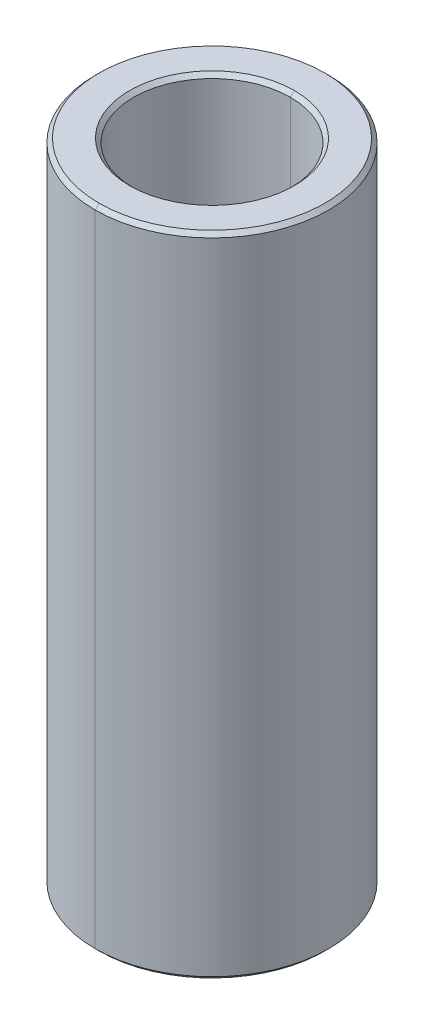
ISO-10303-21;
HEADER;
FILE_DESCRIPTION(('STEP AP214'),'2;1');
FILE_NAME('part.step','',(''),(''),'','','');
FILE_SCHEMA(('AUTOMOTIVE_DESIGN { 1 0 10303 214 1 1 1 1 }'));
ENDSEC;
DATA;
#1=APPLICATION_CONTEXT('core data for automotive mechanical design processes');
#2=APPLICATION_PROTOCOL_DEFINITION('international standard','automotive_design',2000,#1);
#3=PRODUCT_CONTEXT('',#1,'mechanical');
#4=PRODUCT('Part','Part','',(#3));
#5=PRODUCT_RELATED_PRODUCT_CATEGORY('part','',(#4));
#6=PRODUCT_DEFINITION_FORMATION('','',#4);
#7=PRODUCT_DEFINITION_CONTEXT('part definition',#1,'design');
#8=PRODUCT_DEFINITION('design','',#6,#7);
#9=PRODUCT_DEFINITION_SHAPE('','',#8);
#10=(LENGTH_UNIT() NAMED_UNIT(*) SI_UNIT(.MILLI.,.METRE.));
#11=(NAMED_UNIT(*) PLANE_ANGLE_UNIT() SI_UNIT($,.RADIAN.));
#12=(NAMED_UNIT(*) SI_UNIT($,.STERADIAN.) SOLID_ANGLE_UNIT());
#13=UNCERTAINTY_MEASURE_WITH_UNIT(LENGTH_MEASURE(1.E-05),#10,'distance_accuracy_value','');
#14=(GEOMETRIC_REPRESENTATION_CONTEXT(3) GLOBAL_UNCERTAINTY_ASSIGNED_CONTEXT((#13)) GLOBAL_UNIT_ASSIGNED_CONTEXT((#10,
#11,#12)) REPRESENTATION_CONTEXT('',''));
#15=CARTESIAN_POINT('',(0.,0.,0.));
#16=DIRECTION('',(0.,0.,1.));
#17=DIRECTION('',(1.,0.,0.));
#18=AXIS2_PLACEMENT_3D('',#15,#16,#17);
#19=CARTESIAN_POINT('',(0.,8.15,0.));
#20=DIRECTION('',(0.,1.,0.));
#21=DIRECTION('',(0.,0.,1.));
#22=AXIS2_PLACEMENT_3D('',#19,#20,#21);
#23=CONICAL_SURFACE('',#22,2.,0.785398163397448);
#24=DIRECTION('',(0.,0.707106781186548,-0.707106781186548));
#25=VECTOR('',#24,1.);
#26=CARTESIAN_POINT('',(0.,8.15,-2.));
#27=LINE('',#26,#25);
#28=CARTESIAN_POINT('',(0.,8.15,-2.));
#29=VERTEX_POINT('',#28);
#30=CARTESIAN_POINT('',(0.,8.25,-2.1));
#31=VERTEX_POINT('',#30);
#32=EDGE_CURVE('E147',#29,#31,#27,.T.);
#33=ORIENTED_EDGE('',*,*,#32,.F.);
#34=CARTESIAN_POINT('',(0.,8.15,0.));
#35=DIRECTION('',(0.,1.,0.));
#36=DIRECTION('',(0.,0.,1.));
#37=AXIS2_PLACEMENT_3D('',#34,#35,#36);
#38=CIRCLE('',#37,2.);
#39=CARTESIAN_POINT('',(0.,8.15,2.));
#40=VERTEX_POINT('',#39);
#41=EDGE_CURVE('E25',#40,#29,#38,.T.);
#42=ORIENTED_EDGE('',*,*,#41,.F.);
#43=DIRECTION('',(0.,0.707106781186548,0.707106781186548));
#44=VECTOR('',#43,1.);
#45=CARTESIAN_POINT('',(0.,8.15,2.));
#46=LINE('',#45,#44);
#47=CARTESIAN_POINT('',(0.,8.25,2.1));
#48=VERTEX_POINT('',#47);
#49=EDGE_CURVE('E116',#40,#48,#46,.T.);
#50=ORIENTED_EDGE('',*,*,#49,.T.);
#51=CARTESIAN_POINT('',(0.,8.25,0.));
#52=DIRECTION('',(0.,-1.,0.));
#53=DIRECTION('',(0.,0.,1.));
#54=AXIS2_PLACEMENT_3D('',#51,#52,#53);
#55=CIRCLE('',#54,2.1);
#56=EDGE_CURVE('E130',#31,#48,#55,.T.);
#57=ORIENTED_EDGE('',*,*,#56,.F.);
#58=EDGE_LOOP('',(#33,#42,#50,#57));
#59=FACE_BOUND('',#58,.T.);
#60=ADVANCED_FACE('F14',(#59),#23,.F.);
#61=CARTESIAN_POINT('',(0.,-8.25,0.));
#62=DIRECTION('',(0.,-1.,0.));
#63=DIRECTION('',(0.,0.,-1.));
#64=AXIS2_PLACEMENT_3D('',#61,#62,#63);
#65=CONICAL_SURFACE('',#64,2.1,0.785398163397448);
#66=DIRECTION('',(0.,-0.707106781186548,0.707106781186548));
#67=VECTOR('',#66,1.);
#68=CARTESIAN_POINT('',(0.,-8.25,2.1));
#69=LINE('',#68,#67);
#70=CARTESIAN_POINT('',(0.,-8.15,2.));
#71=VERTEX_POINT('',#70);
#72=CARTESIAN_POINT('',(0.,-8.25,2.1));
#73=VERTEX_POINT('',#72);
#74=EDGE_CURVE('E91',#71,#73,#69,.T.);
#75=ORIENTED_EDGE('',*,*,#74,.F.);
#76=CARTESIAN_POINT('',(0.,-8.15,0.));
#77=DIRECTION('',(0.,-1.,0.));
#78=DIRECTION('',(0.,0.,1.));
#79=AXIS2_PLACEMENT_3D('',#76,#77,#78);
#80=CIRCLE('',#79,2.);
#81=CARTESIAN_POINT('',(0.,-8.15,-2.));
#82=VERTEX_POINT('',#81);
#83=EDGE_CURVE('E9',#82,#71,#80,.T.);
#84=ORIENTED_EDGE('',*,*,#83,.F.);
#85=DIRECTION('',(0.,-0.707106781186548,-0.707106781186548));
#86=VECTOR('',#85,1.);
#87=CARTESIAN_POINT('',(0.,-8.25,-2.1));
#88=LINE('',#87,#86);
#89=CARTESIAN_POINT('',(0.,-8.25,-2.1));
#90=VERTEX_POINT('',#89);
#91=EDGE_CURVE('E94',#82,#90,#88,.T.);
#92=ORIENTED_EDGE('',*,*,#91,.T.);
#93=CARTESIAN_POINT('',(0.,-8.25,0.));
#94=DIRECTION('',(0.,1.,0.));
#95=DIRECTION('',(0.,0.,1.));
#96=AXIS2_PLACEMENT_3D('',#93,#94,#95);
#97=CIRCLE('',#96,2.1);
#98=EDGE_CURVE('E87',#73,#90,#97,.T.);
#99=ORIENTED_EDGE('',*,*,#98,.F.);
#100=EDGE_LOOP('',(#75,#84,#92,#99));
#101=FACE_BOUND('',#100,.T.);
#102=ADVANCED_FACE('F89',(#101),#65,.F.);
#103=CARTESIAN_POINT('',(0.,8.25,0.));
#104=DIRECTION('',(0.,-1.,0.));
#105=DIRECTION('',(0.,0.,-1.));
#106=AXIS2_PLACEMENT_3D('',#103,#104,#105);
#107=CONICAL_SURFACE('',#106,2.875,0.785398163397457);
#108=DIRECTION('',(0.,-0.707106781186542,0.707106781186554));
#109=VECTOR('',#108,1.);
#110=CARTESIAN_POINT('',(0.,8.25,2.875));
#111=LINE('',#110,#109);
#112=CARTESIAN_POINT('',(0.,8.25,2.875));
#113=VERTEX_POINT('',#112);
#114=CARTESIAN_POINT('',(0.,8.15,2.975));
#115=VERTEX_POINT('',#114);
#116=EDGE_CURVE('E141',#113,#115,#111,.T.);
#117=ORIENTED_EDGE('',*,*,#116,.F.);
#118=CARTESIAN_POINT('',(0.,8.25,0.));
#119=DIRECTION('',(0.,1.,0.));
#120=DIRECTION('',(0.,0.,1.));
#121=AXIS2_PLACEMENT_3D('',#118,#119,#120);
#122=CIRCLE('',#121,2.875);
#123=CARTESIAN_POINT('',(0.,8.25,-2.875));
#124=VERTEX_POINT('',#123);
#125=EDGE_CURVE('E145',#124,#113,#122,.T.);
#126=ORIENTED_EDGE('',*,*,#125,.F.);
#127=DIRECTION('',(0.,-0.707106781186542,-0.707106781186554));
#128=VECTOR('',#127,1.);
#129=CARTESIAN_POINT('',(0.,8.25,-2.875));
#130=LINE('',#129,#128);
#131=CARTESIAN_POINT('',(0.,8.15,-2.975));
#132=VERTEX_POINT('',#131);
#133=EDGE_CURVE('E161',#124,#132,#130,.T.);
#134=ORIENTED_EDGE('',*,*,#133,.T.);
#135=CARTESIAN_POINT('',(0.,8.15,0.));
#136=DIRECTION('',(0.,-1.,0.));
#137=DIRECTION('',(0.,0.,1.));
#138=AXIS2_PLACEMENT_3D('',#135,#136,#137);
#139=CIRCLE('',#138,2.975);
#140=EDGE_CURVE('E98',#115,#132,#139,.T.);
#141=ORIENTED_EDGE('',*,*,#140,.F.);
#142=EDGE_LOOP('',(#117,#126,#134,#141));
#143=FACE_BOUND('',#142,.T.);
#144=ADVANCED_FACE('F224',(#143),#107,.T.);
#145=CARTESIAN_POINT('',(0.,-8.15,0.));
#146=DIRECTION('',(0.,1.,0.));
#147=DIRECTION('',(0.,0.,1.));
#148=AXIS2_PLACEMENT_3D('',#145,#146,#147);
#149=CONICAL_SURFACE('',#148,2.975,0.785398163397448);
#150=DIRECTION('',(0.,0.707106781186548,-0.707106781186548));
#151=VECTOR('',#150,1.);
#152=CARTESIAN_POINT('',(0.,-8.15,-2.975));
#153=LINE('',#152,#151);
#154=CARTESIAN_POINT('',(0.,-8.25,-2.875));
#155=VERTEX_POINT('',#154);
#156=CARTESIAN_POINT('',(0.,-8.15,-2.975));
#157=VERTEX_POINT('',#156);
#158=EDGE_CURVE('E156',#155,#157,#153,.T.);
#159=ORIENTED_EDGE('',*,*,#158,.F.);
#160=CARTESIAN_POINT('',(0.,-8.25,0.));
#161=DIRECTION('',(0.,-1.,0.));
#162=DIRECTION('',(0.,0.,1.));
#163=AXIS2_PLACEMENT_3D('',#160,#161,#162);
#164=CIRCLE('',#163,2.875);
#165=CARTESIAN_POINT('',(0.,-8.25,2.875));
#166=VERTEX_POINT('',#165);
#167=EDGE_CURVE('E99',#166,#155,#164,.T.);
#168=ORIENTED_EDGE('',*,*,#167,.F.);
#169=DIRECTION('',(0.,0.707106781186548,0.707106781186548));
#170=VECTOR('',#169,1.);
#171=CARTESIAN_POINT('',(0.,-8.15,2.975));
#172=LINE('',#171,#170);
#173=CARTESIAN_POINT('',(0.,-8.15,2.975));
#174=VERTEX_POINT('',#173);
#175=EDGE_CURVE('E127',#166,#174,#172,.T.);
#176=ORIENTED_EDGE('',*,*,#175,.T.);
#177=CARTESIAN_POINT('',(0.,-8.15,0.));
#178=DIRECTION('',(0.,1.,0.));
#179=DIRECTION('',(0.,0.,1.));
#180=AXIS2_PLACEMENT_3D('',#177,#178,#179);
#181=CIRCLE('',#180,2.975);
#182=EDGE_CURVE('E40',#157,#174,#181,.T.);
#183=ORIENTED_EDGE('',*,*,#182,.F.);
#184=EDGE_LOOP('',(#159,#168,#176,#183));
#185=FACE_BOUND('',#184,.T.);
#186=ADVANCED_FACE('F241',(#185),#149,.T.);
#187=CARTESIAN_POINT('',(0.,8.25,0.));
#188=DIRECTION('',(0.,-1.,0.));
#189=DIRECTION('',(0.,0.,-1.));
#190=AXIS2_PLACEMENT_3D('',#187,#188,#189);
#191=CYLINDRICAL_SURFACE('',#190,2.);
#192=DIRECTION('',(0.,-1.,0.));
#193=VECTOR('',#192,1.);
#194=CARTESIAN_POINT('',(0.,8.25,2.));
#195=LINE('',#194,#193);
#196=EDGE_CURVE('E122',#40,#71,#195,.T.);
#197=ORIENTED_EDGE('',*,*,#196,.F.);
#198=ORIENTED_EDGE('',*,*,#41,.T.);
#199=DIRECTION('',(0.,-1.,0.));
#200=VECTOR('',#199,1.);
#201=CARTESIAN_POINT('',(0.,8.25,-2.));
#202=LINE('',#201,#200);
#203=EDGE_CURVE('E126',#29,#82,#202,.T.);
#204=ORIENTED_EDGE('',*,*,#203,.T.);
#205=ORIENTED_EDGE('',*,*,#83,.T.);
#206=EDGE_LOOP('',(#197,#198,#204,#205));
#207=FACE_BOUND('',#206,.T.);
#208=ADVANCED_FACE('F234',(#207),#191,.F.);
#209=CARTESIAN_POINT('',(0.,8.25,0.));
#210=DIRECTION('',(0.,-1.,0.));
#211=DIRECTION('',(0.,0.,-1.));
#212=AXIS2_PLACEMENT_3D('',#209,#210,#211);
#213=CYLINDRICAL_SURFACE('',#212,2.975);
#214=DIRECTION('',(0.,-1.,0.));
#215=VECTOR('',#214,1.);
#216=CARTESIAN_POINT('',(0.,8.25,2.975));
#217=LINE('',#216,#215);
#218=EDGE_CURVE('E146',#115,#174,#217,.T.);
#219=ORIENTED_EDGE('',*,*,#218,.F.);
#220=ORIENTED_EDGE('',*,*,#140,.T.);
#221=DIRECTION('',(0.,-1.,0.));
#222=VECTOR('',#221,1.);
#223=CARTESIAN_POINT('',(0.,8.25,-2.975));
#224=LINE('',#223,#222);
#225=EDGE_CURVE('E142',#132,#157,#224,.T.);
#226=ORIENTED_EDGE('',*,*,#225,.T.);
#227=ORIENTED_EDGE('',*,*,#182,.T.);
#228=EDGE_LOOP('',(#219,#220,#226,#227));
#229=FACE_BOUND('',#228,.T.);
#230=ADVANCED_FACE('F232',(#229),#213,.T.);
#231=CARTESIAN_POINT('',(0.,-8.25,0.));
#232=DIRECTION('',(0.,1.,0.));
#233=DIRECTION('',(1.,0.,0.));
#234=AXIS2_PLACEMENT_3D('',#231,#232,#233);
#235=PLANE('',#234);
#236=CARTESIAN_POINT('',(0.,-8.25,0.));
#237=DIRECTION('',(0.,1.,0.));
#238=DIRECTION('',(0.,0.,1.));
#239=AXIS2_PLACEMENT_3D('',#236,#237,#238);
#240=CIRCLE('',#239,2.1);
#241=EDGE_CURVE('E101',#90,#73,#240,.T.);
#242=ORIENTED_EDGE('',*,*,#241,.T.);
#243=ORIENTED_EDGE('',*,*,#98,.T.);
#244=EDGE_LOOP('',(#242,#243));
#245=FACE_BOUND('',#244,.T.);
#246=ORIENTED_EDGE('',*,*,#167,.T.);
#247=CARTESIAN_POINT('',(0.,-8.25,0.));
#248=DIRECTION('',(0.,-1.,0.));
#249=DIRECTION('',(0.,0.,1.));
#250=AXIS2_PLACEMENT_3D('',#247,#248,#249);
#251=CIRCLE('',#250,2.875);
#252=EDGE_CURVE('E210',#155,#166,#251,.T.);
#253=ORIENTED_EDGE('',*,*,#252,.T.);
#254=EDGE_LOOP('',(#246,#253));
#255=FACE_BOUND('',#254,.T.);
#256=ADVANCED_FACE('F102',(#245,#255),#235,.F.);
#257=CARTESIAN_POINT('',(0.,8.25,0.));
#258=DIRECTION('',(0.,1.,0.));
#259=DIRECTION('',(1.,0.,0.));
#260=AXIS2_PLACEMENT_3D('',#257,#258,#259);
#261=PLANE('',#260);
#262=CARTESIAN_POINT('',(0.,8.25,0.));
#263=DIRECTION('',(0.,-1.,0.));
#264=DIRECTION('',(0.,0.,1.));
#265=AXIS2_PLACEMENT_3D('',#262,#263,#264);
#266=CIRCLE('',#265,2.1);
#267=EDGE_CURVE('E135',#48,#31,#266,.T.);
#268=ORIENTED_EDGE('',*,*,#267,.T.);
#269=ORIENTED_EDGE('',*,*,#56,.T.);
#270=EDGE_LOOP('',(#268,#269));
#271=FACE_BOUND('',#270,.T.);
#272=ORIENTED_EDGE('',*,*,#125,.T.);
#273=CARTESIAN_POINT('',(0.,8.25,0.));
#274=DIRECTION('',(0.,1.,0.));
#275=DIRECTION('',(0.,0.,1.));
#276=AXIS2_PLACEMENT_3D('',#273,#274,#275);
#277=CIRCLE('',#276,2.875);
#278=EDGE_CURVE('E121',#113,#124,#277,.T.);
#279=ORIENTED_EDGE('',*,*,#278,.T.);
#280=EDGE_LOOP('',(#272,#279));
#281=FACE_BOUND('',#280,.T.);
#282=ADVANCED_FACE('F16',(#271,#281),#261,.T.);
#283=CARTESIAN_POINT('',(0.,8.25,0.));
#284=DIRECTION('',(0.,-1.,0.));
#285=DIRECTION('',(0.,0.,-1.));
#286=AXIS2_PLACEMENT_3D('',#283,#284,#285);
#287=CYLINDRICAL_SURFACE('',#286,2.975);
#288=CARTESIAN_POINT('',(0.,8.15,0.));
#289=DIRECTION('',(0.,-1.,0.));
#290=DIRECTION('',(0.,0.,1.));
#291=AXIS2_PLACEMENT_3D('',#288,#289,#290);
#292=CIRCLE('',#291,2.975);
#293=EDGE_CURVE('E157',#132,#115,#292,.T.);
#294=ORIENTED_EDGE('',*,*,#293,.T.);
#295=ORIENTED_EDGE('',*,*,#218,.T.);
#296=CARTESIAN_POINT('',(0.,-8.15,0.));
#297=DIRECTION('',(0.,1.,0.));
#298=DIRECTION('',(0.,0.,1.));
#299=AXIS2_PLACEMENT_3D('',#296,#297,#298);
#300=CIRCLE('',#299,2.975);
#301=EDGE_CURVE('E152',#174,#157,#300,.T.);
#302=ORIENTED_EDGE('',*,*,#301,.T.);
#303=ORIENTED_EDGE('',*,*,#225,.F.);
#304=EDGE_LOOP('',(#294,#295,#302,#303));
#305=FACE_BOUND('',#304,.T.);
#306=ADVANCED_FACE('F230',(#305),#287,.T.);
#307=CARTESIAN_POINT('',(0.,8.25,0.));
#308=DIRECTION('',(0.,-1.,0.));
#309=DIRECTION('',(0.,0.,-1.));
#310=AXIS2_PLACEMENT_3D('',#307,#308,#309);
#311=CYLINDRICAL_SURFACE('',#310,2.);
#312=CARTESIAN_POINT('',(0.,8.15,0.));
#313=DIRECTION('',(0.,1.,0.));
#314=DIRECTION('',(0.,0.,1.));
#315=AXIS2_PLACEMENT_3D('',#312,#313,#314);
#316=CIRCLE('',#315,2.);
#317=EDGE_CURVE('E150',#29,#40,#316,.T.);
#318=ORIENTED_EDGE('',*,*,#317,.T.);
#319=ORIENTED_EDGE('',*,*,#196,.T.);
#320=CARTESIAN_POINT('',(0.,-8.15,0.));
#321=DIRECTION('',(0.,-1.,0.));
#322=DIRECTION('',(0.,0.,1.));
#323=AXIS2_PLACEMENT_3D('',#320,#321,#322);
#324=CIRCLE('',#323,2.);
#325=EDGE_CURVE('E18',#71,#82,#324,.T.);
#326=ORIENTED_EDGE('',*,*,#325,.T.);
#327=ORIENTED_EDGE('',*,*,#203,.F.);
#328=EDGE_LOOP('',(#318,#319,#326,#327));
#329=FACE_BOUND('',#328,.T.);
#330=ADVANCED_FACE('F254',(#329),#311,.F.);
#331=CARTESIAN_POINT('',(0.,-8.15,0.));
#332=DIRECTION('',(0.,1.,0.));
#333=DIRECTION('',(0.,0.,1.));
#334=AXIS2_PLACEMENT_3D('',#331,#332,#333);
#335=CONICAL_SURFACE('',#334,2.975,0.785398163397448);
#336=ORIENTED_EDGE('',*,*,#252,.F.);
#337=ORIENTED_EDGE('',*,*,#158,.T.);
#338=ORIENTED_EDGE('',*,*,#301,.F.);
#339=ORIENTED_EDGE('',*,*,#175,.F.);
#340=EDGE_LOOP('',(#336,#337,#338,#339));
#341=FACE_BOUND('',#340,.T.);
#342=ADVANCED_FACE('F259',(#341),#335,.T.);
#343=CARTESIAN_POINT('',(0.,8.25,0.));
#344=DIRECTION('',(0.,-1.,0.));
#345=DIRECTION('',(0.,0.,-1.));
#346=AXIS2_PLACEMENT_3D('',#343,#344,#345);
#347=CONICAL_SURFACE('',#346,2.875,0.785398163397457);
#348=ORIENTED_EDGE('',*,*,#278,.F.);
#349=ORIENTED_EDGE('',*,*,#116,.T.);
#350=ORIENTED_EDGE('',*,*,#293,.F.);
#351=ORIENTED_EDGE('',*,*,#133,.F.);
#352=EDGE_LOOP('',(#348,#349,#350,#351));
#353=FACE_BOUND('',#352,.T.);
#354=ADVANCED_FACE('F228',(#353),#347,.T.);
#355=CARTESIAN_POINT('',(0.,-8.25,0.));
#356=DIRECTION('',(0.,-1.,0.));
#357=DIRECTION('',(0.,0.,-1.));
#358=AXIS2_PLACEMENT_3D('',#355,#356,#357);
#359=CONICAL_SURFACE('',#358,2.1,0.785398163397448);
#360=ORIENTED_EDGE('',*,*,#325,.F.);
#361=ORIENTED_EDGE('',*,*,#74,.T.);
#362=ORIENTED_EDGE('',*,*,#241,.F.);
#363=ORIENTED_EDGE('',*,*,#91,.F.);
#364=EDGE_LOOP('',(#360,#361,#362,#363));
#365=FACE_BOUND('',#364,.T.);
#366=ADVANCED_FACE('F107',(#365),#359,.F.);
#367=CARTESIAN_POINT('',(0.,8.15,0.));
#368=DIRECTION('',(0.,1.,0.));
#369=DIRECTION('',(0.,0.,1.));
#370=AXIS2_PLACEMENT_3D('',#367,#368,#369);
#371=CONICAL_SURFACE('',#370,2.,0.785398163397448);
#372=ORIENTED_EDGE('',*,*,#317,.F.);
#373=ORIENTED_EDGE('',*,*,#32,.T.);
#374=ORIENTED_EDGE('',*,*,#267,.F.);
#375=ORIENTED_EDGE('',*,*,#49,.F.);
#376=EDGE_LOOP('',(#372,#373,#374,#375));
#377=FACE_BOUND('',#376,.T.);
#378=ADVANCED_FACE('F192',(#377),#371,.F.);
#379=CLOSED_SHELL('',(#60,#102,#144,#186,#208,#230,#256,#282,#306,#330,#342,#354,#366,#378));
#380=MANIFOLD_SOLID_BREP('B1',#379);
#381=ADVANCED_BREP_SHAPE_REPRESENTATION('',(#18,#380),#14);
#382=SHAPE_DEFINITION_REPRESENTATION(#9,#381);
ENDSEC;
END-ISO-10303-21;
